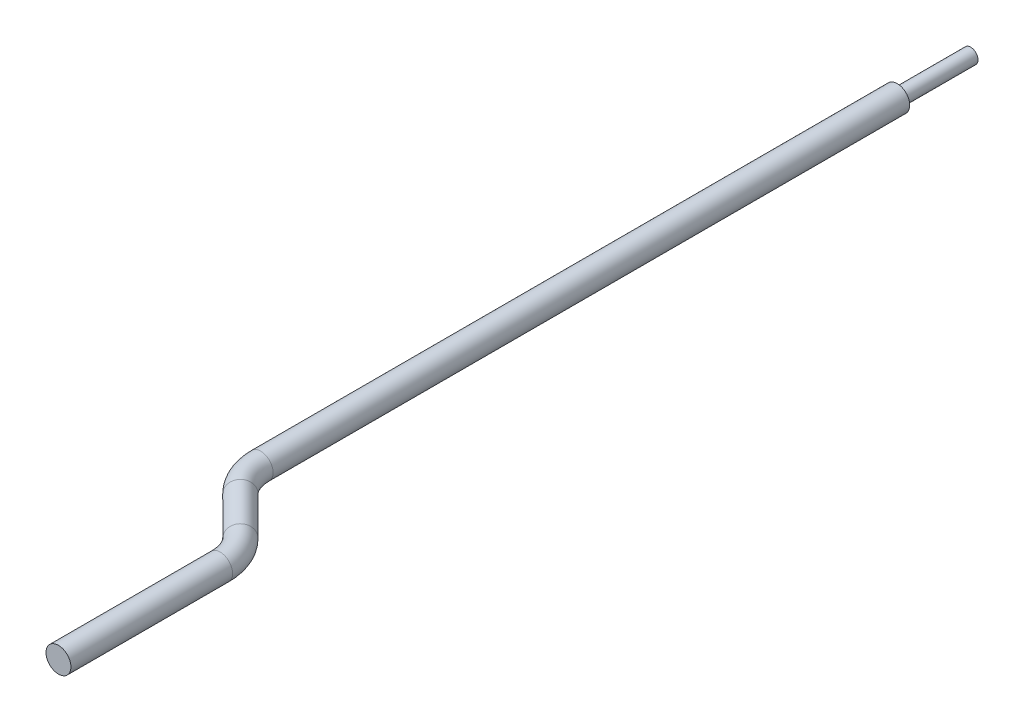
ISO-10303-21;
HEADER;
FILE_DESCRIPTION(('STEP AP214'),'2;1');
FILE_NAME('part.step','',(''),(''),'','','');
FILE_SCHEMA(('AUTOMOTIVE_DESIGN { 1 0 10303 214 1 1 1 1 }'));
ENDSEC;
DATA;
#1=APPLICATION_CONTEXT('core data for automotive mechanical design processes');
#2=APPLICATION_PROTOCOL_DEFINITION('international standard','automotive_design',2000,#1);
#3=PRODUCT_CONTEXT('',#1,'mechanical');
#4=PRODUCT('Part','Part','',(#3));
#5=PRODUCT_RELATED_PRODUCT_CATEGORY('part','',(#4));
#6=PRODUCT_DEFINITION_FORMATION('','',#4);
#7=PRODUCT_DEFINITION_CONTEXT('part definition',#1,'design');
#8=PRODUCT_DEFINITION('design','',#6,#7);
#9=PRODUCT_DEFINITION_SHAPE('','',#8);
#10=(LENGTH_UNIT() NAMED_UNIT(*) SI_UNIT(.MILLI.,.METRE.));
#11=(NAMED_UNIT(*) PLANE_ANGLE_UNIT() SI_UNIT($,.RADIAN.));
#12=(NAMED_UNIT(*) SI_UNIT($,.STERADIAN.) SOLID_ANGLE_UNIT());
#13=UNCERTAINTY_MEASURE_WITH_UNIT(LENGTH_MEASURE(1.E-05),#10,'distance_accuracy_value','');
#14=(GEOMETRIC_REPRESENTATION_CONTEXT(3) GLOBAL_UNCERTAINTY_ASSIGNED_CONTEXT((#13)) GLOBAL_UNIT_ASSIGNED_CONTEXT((#10,
#11,#12)) REPRESENTATION_CONTEXT('',''));
#15=CARTESIAN_POINT('',(0.,0.,0.));
#16=DIRECTION('',(0.,0.,1.));
#17=DIRECTION('',(1.,0.,0.));
#18=AXIS2_PLACEMENT_3D('',#15,#16,#17);
#19=CARTESIAN_POINT('',(0.,0.,35.56));
#20=DIRECTION('',(0.,0.,-1.));
#21=DIRECTION('',(-1.,0.,0.));
#22=AXIS2_PLACEMENT_3D('',#19,#20,#21);
#23=CYLINDRICAL_SURFACE('',#22,0.6477);
#24=CARTESIAN_POINT('',(0.,0.,36.83));
#25=DIRECTION('',(0.,0.,1.));
#26=DIRECTION('',(1.,0.,0.));
#27=AXIS2_PLACEMENT_3D('',#24,#25,#26);
#28=CIRCLE('',#27,0.6477);
#29=CARTESIAN_POINT('',(-0.647700000000008,0.,36.83));
#30=VERTEX_POINT('',#29);
#31=EDGE_CURVE('E49',#30,#30,#28,.T.);
#32=ORIENTED_EDGE('',*,*,#31,.F.);
#33=EDGE_LOOP('',(#32));
#34=FACE_BOUND('',#33,.T.);
#35=CARTESIAN_POINT('',(0.,0.,3.81));
#36=DIRECTION('',(0.,0.,-1.));
#37=DIRECTION('',(-1.,0.,0.));
#38=AXIS2_PLACEMENT_3D('',#35,#36,#37);
#39=CIRCLE('',#38,0.6477);
#40=CARTESIAN_POINT('',(-0.647700000000001,0.,3.81));
#41=VERTEX_POINT('',#40);
#42=EDGE_CURVE('E56',#41,#41,#39,.T.);
#43=ORIENTED_EDGE('',*,*,#42,.F.);
#44=EDGE_LOOP('',(#43));
#45=FACE_BOUND('',#44,.T.);
#46=ADVANCED_FACE('F30',(#34,#45),#23,.T.);
#47=CARTESIAN_POINT('',(3.4798,0.,42.4140048968553));
#48=DIRECTION('',(0.,0.,1.));
#49=DIRECTION('',(1.,0.,0.));
#50=AXIS2_PLACEMENT_3D('',#47,#48,#49);
#51=CYLINDRICAL_SURFACE('',#50,0.6477);
#52=CARTESIAN_POINT('',(3.4798,0.,42.4140048968553));
#53=DIRECTION('',(0.,0.,1.));
#54=DIRECTION('',(1.,0.,0.));
#55=AXIS2_PLACEMENT_3D('',#52,#53,#54);
#56=CIRCLE('',#55,0.6477);
#57=CARTESIAN_POINT('',(4.12749999999999,0.,42.4140048968553));
#58=VERTEX_POINT('',#57);
#59=EDGE_CURVE('E36',#58,#58,#56,.T.);
#60=ORIENTED_EDGE('',*,*,#59,.T.);
#61=EDGE_LOOP('',(#60));
#62=FACE_BOUND('',#61,.T.);
#63=CARTESIAN_POINT('',(3.47979999999999,0.,50.8));
#64=DIRECTION('',(0.,0.,1.));
#65=DIRECTION('',(1.,0.,0.));
#66=AXIS2_PLACEMENT_3D('',#63,#64,#65);
#67=CIRCLE('',#66,0.6477);
#68=CARTESIAN_POINT('',(4.12749999999999,0.,50.8));
#69=VERTEX_POINT('',#68);
#70=EDGE_CURVE('E10',#69,#69,#67,.T.);
#71=ORIENTED_EDGE('',*,*,#70,.F.);
#72=EDGE_LOOP('',(#71));
#73=FACE_BOUND('',#72,.T.);
#74=ADVANCED_FACE('F66',(#62,#73),#51,.T.);
#75=CARTESIAN_POINT('',(0.939799999999987,0.,42.4140048968553));
#76=DIRECTION('',(0.,-1.,0.));
#77=DIRECTION('',(0.,0.,-1.));
#78=AXIS2_PLACEMENT_3D('',#75,#76,#77);
#79=TOROIDAL_SURFACE('',#78,2.54,0.6477);
#80=CARTESIAN_POINT('',(2.7358512242138,0.,40.6179536726415));
#81=DIRECTION('',(0.70710678118655,0.,0.707106781186547));
#82=DIRECTION('',(0.707106781186548,0.,-0.707106781186549));
#83=AXIS2_PLACEMENT_3D('',#80,#81,#82);
#84=CIRCLE('',#83,0.6477);
#85=CARTESIAN_POINT('',(3.19384428638833,0.,40.1599606104669));
#86=VERTEX_POINT('',#85);
#87=EDGE_CURVE('E40',#86,#86,#84,.T.);
#88=CARTESIAN_POINT('',(0.939799999999987,0.,42.4140048968553));
#89=DIRECTION('',(0.,-1.,0.));
#90=DIRECTION('',(0.,0.,-1.));
#91=AXIS2_PLACEMENT_3D('',#88,#89,#90);
#92=CIRCLE('',#91,3.1877);
#93=EDGE_CURVE('',#86,#58,#92,.T.);
#94=ORIENTED_EDGE('',*,*,#87,.T.);
#95=ORIENTED_EDGE('',*,*,#59,.F.);
#96=ORIENTED_EDGE('',*,*,#93,.T.);
#97=ORIENTED_EDGE('',*,*,#93,.F.);
#98=EDGE_LOOP('',(#94,#96,#95,#97));
#99=FACE_BOUND('',#98,.T.);
#100=ADVANCED_FACE('F71',(#99),#79,.T.);
#101=CARTESIAN_POINT('',(0.743948775786166,0.,38.6260512242138));
#102=DIRECTION('',(0.707106781186551,0.,0.707106781186546));
#103=DIRECTION('',(0.707106781186547,0.,-0.707106781186549));
#104=AXIS2_PLACEMENT_3D('',#101,#102,#103);
#105=CYLINDRICAL_SURFACE('',#104,0.6477);
#106=CARTESIAN_POINT('',(0.743948775786166,0.,38.6260512242138));
#107=DIRECTION('',(0.70710678118655,0.,0.707106781186547));
#108=DIRECTION('',(0.707106781186548,0.,-0.707106781186549));
#109=AXIS2_PLACEMENT_3D('',#106,#107,#108);
#110=CIRCLE('',#109,0.6477);
#111=CARTESIAN_POINT('',(0.285955713611639,0.,39.0840442863884));
#112=VERTEX_POINT('',#111);
#113=EDGE_CURVE('E44',#112,#112,#110,.T.);
#114=ORIENTED_EDGE('',*,*,#113,.T.);
#115=EDGE_LOOP('',(#114));
#116=FACE_BOUND('',#115,.T.);
#117=ORIENTED_EDGE('',*,*,#87,.F.);
#118=EDGE_LOOP('',(#117));
#119=FACE_BOUND('',#118,.T.);
#120=ADVANCED_FACE('F79',(#116,#119),#105,.T.);
#121=CARTESIAN_POINT('',(2.53999999999999,0.,36.83));
#122=DIRECTION('',(0.,1.,0.));
#123=DIRECTION('',(0.,0.,1.));
#124=AXIS2_PLACEMENT_3D('',#121,#122,#123);
#125=TOROIDAL_SURFACE('',#124,2.54,0.6477);
#126=CARTESIAN_POINT('',(2.53999999999999,0.,36.83));
#127=DIRECTION('',(0.,1.,0.));
#128=DIRECTION('',(0.,0.,1.));
#129=AXIS2_PLACEMENT_3D('',#126,#127,#128);
#130=CIRCLE('',#129,3.1877);
#131=EDGE_CURVE('',#30,#112,#130,.T.);
#132=ORIENTED_EDGE('',*,*,#31,.T.);
#133=ORIENTED_EDGE('',*,*,#113,.F.);
#134=ORIENTED_EDGE('',*,*,#131,.T.);
#135=ORIENTED_EDGE('',*,*,#131,.F.);
#136=EDGE_LOOP('',(#132,#134,#133,#135));
#137=FACE_BOUND('',#136,.T.);
#138=ADVANCED_FACE('F75',(#137),#125,.T.);
#139=CARTESIAN_POINT('',(3.47979999999999,0.,50.8));
#140=DIRECTION('',(0.,0.,1.));
#141=DIRECTION('',(1.,0.,0.));
#142=AXIS2_PLACEMENT_3D('',#139,#140,#141);
#143=PLANE('',#142);
#144=ORIENTED_EDGE('',*,*,#70,.T.);
#145=EDGE_LOOP('',(#144));
#146=FACE_BOUND('',#145,.T.);
#147=ADVANCED_FACE('F78',(#146),#143,.T.);
#148=CARTESIAN_POINT('',(0.,0.,3.81));
#149=DIRECTION('',(0.,0.,-1.));
#150=DIRECTION('',(-1.,0.,0.));
#151=AXIS2_PLACEMENT_3D('',#148,#149,#150);
#152=CYLINDRICAL_SURFACE('',#151,0.381);
#153=CARTESIAN_POINT('',(0.,0.,3.81));
#154=DIRECTION('',(0.,0.,-1.));
#155=DIRECTION('',(-1.,0.,0.));
#156=AXIS2_PLACEMENT_3D('',#153,#154,#155);
#157=CIRCLE('',#156,0.381);
#158=CARTESIAN_POINT('',(-0.381000000000001,0.,3.81));
#159=VERTEX_POINT('',#158);
#160=EDGE_CURVE('E52',#159,#159,#157,.F.);
#161=ORIENTED_EDGE('',*,*,#160,.F.);
#162=EDGE_LOOP('',(#161));
#163=FACE_BOUND('',#162,.T.);
#164=CARTESIAN_POINT('',(0.,0.,0.));
#165=DIRECTION('',(0.,0.,-1.));
#166=DIRECTION('',(-1.,0.,0.));
#167=AXIS2_PLACEMENT_3D('',#164,#165,#166);
#168=CIRCLE('',#167,0.381);
#169=CARTESIAN_POINT('',(-0.381000000000001,0.,0.));
#170=VERTEX_POINT('',#169);
#171=EDGE_CURVE('E53',#170,#170,#168,.F.);
#172=ORIENTED_EDGE('',*,*,#171,.T.);
#173=EDGE_LOOP('',(#172));
#174=FACE_BOUND('',#173,.T.);
#175=ADVANCED_FACE('F99',(#163,#174),#152,.T.);
#176=CARTESIAN_POINT('',(0.,0.,3.81));
#177=DIRECTION('',(0.,0.,-1.));
#178=DIRECTION('',(-1.,0.,0.));
#179=AXIS2_PLACEMENT_3D('',#176,#177,#178);
#180=PLANE('',#179);
#181=ORIENTED_EDGE('',*,*,#42,.T.);
#182=EDGE_LOOP('',(#181));
#183=FACE_BOUND('',#182,.T.);
#184=ORIENTED_EDGE('',*,*,#160,.T.);
#185=EDGE_LOOP('',(#184));
#186=FACE_BOUND('',#185,.T.);
#187=ADVANCED_FACE('F62',(#183,#186),#180,.T.);
#188=CARTESIAN_POINT('',(0.,0.,0.));
#189=DIRECTION('',(0.,0.,1.));
#190=DIRECTION('',(1.,0.,0.));
#191=AXIS2_PLACEMENT_3D('',#188,#189,#190);
#192=PLANE('',#191);
#193=ORIENTED_EDGE('',*,*,#171,.F.);
#194=EDGE_LOOP('',(#193));
#195=FACE_BOUND('',#194,.T.);
#196=ADVANCED_FACE('F93',(#195),#192,.F.);
#197=CLOSED_SHELL('',(#46,#74,#100,#120,#138,#147,#175,#187,#196));
#198=MANIFOLD_SOLID_BREP('B2',#197);
#199=ADVANCED_BREP_SHAPE_REPRESENTATION('',(#18,#198),#14);
#200=SHAPE_DEFINITION_REPRESENTATION(#9,#199);
ENDSEC;
END-ISO-10303-21;
